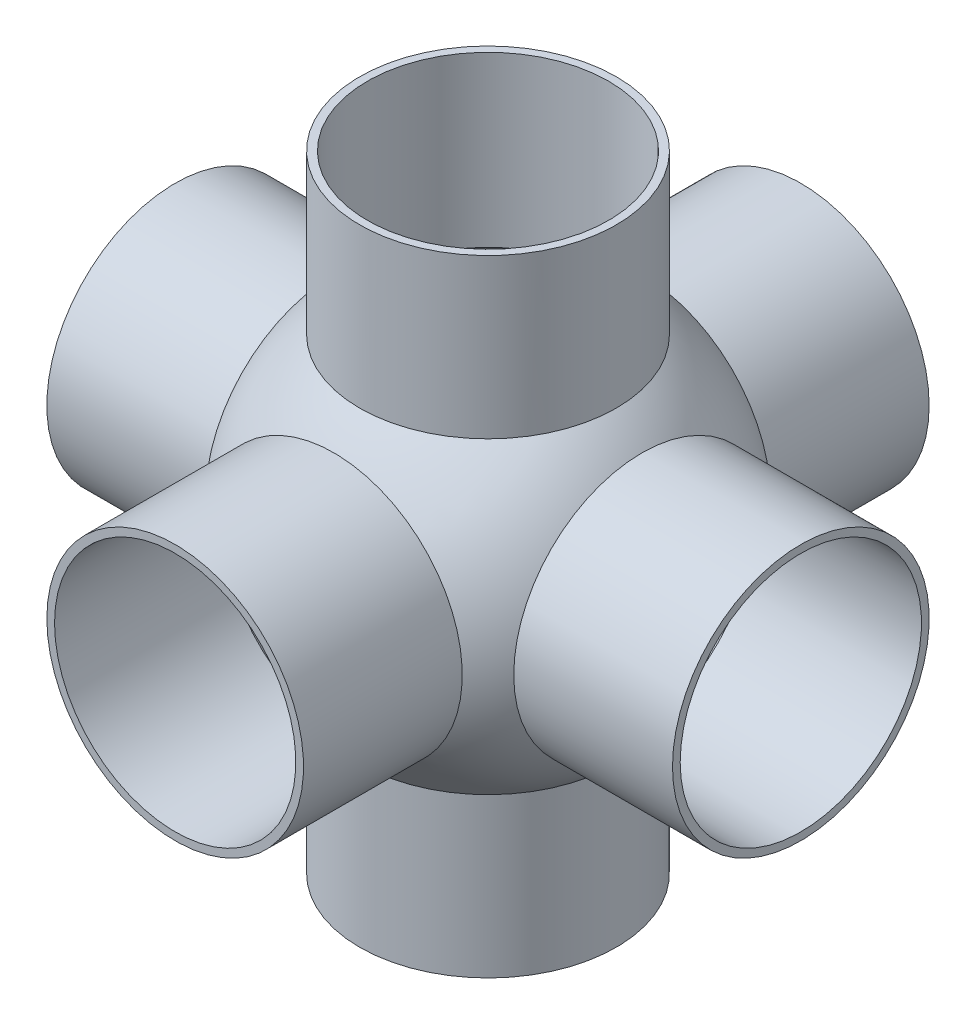
ISO-10303-21;
HEADER;
FILE_DESCRIPTION(('STEP AP214'),'2;1');
FILE_NAME('part.step','',(''),(''),'','','');
FILE_SCHEMA(('AUTOMOTIVE_DESIGN { 1 0 10303 214 1 1 1 1 }'));
ENDSEC;
DATA;
#1=APPLICATION_CONTEXT('core data for automotive mechanical design processes');
#2=APPLICATION_PROTOCOL_DEFINITION('international standard','automotive_design',2000,#1);
#3=PRODUCT_CONTEXT('',#1,'mechanical');
#4=PRODUCT('Part','Part','',(#3));
#5=PRODUCT_RELATED_PRODUCT_CATEGORY('part','',(#4));
#6=PRODUCT_DEFINITION_FORMATION('','',#4);
#7=PRODUCT_DEFINITION_CONTEXT('part definition',#1,'design');
#8=PRODUCT_DEFINITION('design','',#6,#7);
#9=PRODUCT_DEFINITION_SHAPE('','',#8);
#10=(LENGTH_UNIT() NAMED_UNIT(*) SI_UNIT(.MILLI.,.METRE.));
#11=(NAMED_UNIT(*) PLANE_ANGLE_UNIT() SI_UNIT($,.RADIAN.));
#12=(NAMED_UNIT(*) SI_UNIT($,.STERADIAN.) SOLID_ANGLE_UNIT());
#13=UNCERTAINTY_MEASURE_WITH_UNIT(LENGTH_MEASURE(1.E-05),#10,'distance_accuracy_value','');
#14=(GEOMETRIC_REPRESENTATION_CONTEXT(3) GLOBAL_UNCERTAINTY_ASSIGNED_CONTEXT((#13)) GLOBAL_UNIT_ASSIGNED_CONTEXT((#10,
#11,#12)) REPRESENTATION_CONTEXT('',''));
#15=CARTESIAN_POINT('',(0.,0.,0.));
#16=DIRECTION('',(0.,0.,1.));
#17=DIRECTION('',(1.,0.,0.));
#18=AXIS2_PLACEMENT_3D('',#15,#16,#17);
#19=CARTESIAN_POINT('',(0.,0.,0.));
#20=DIRECTION('',(0.,0.,1.));
#21=DIRECTION('',(-1.,0.,0.));
#22=AXIS2_PLACEMENT_3D('',#19,#20,#21);
#23=SPHERICAL_SURFACE('',#22,76.3270000000001);
#24=CARTESIAN_POINT('',(0.,-56.966401688,0.));
#25=DIRECTION('',(0.,-1.,0.));
#26=DIRECTION('',(0.,0.,-1.));
#27=AXIS2_PLACEMENT_3D('',#24,#25,#26);
#28=CIRCLE('',#27,50.8000000759985);
#29=CARTESIAN_POINT('',(0.,-56.966401688,-50.8000000759985));
#30=VERTEX_POINT('',#29);
#31=EDGE_CURVE('E92',#30,#30,#28,.T.);
#32=ORIENTED_EDGE('',*,*,#31,.T.);
#33=EDGE_LOOP('',(#32));
#34=FACE_BOUND('',#33,.T.);
#35=CARTESIAN_POINT('',(0.,56.966401688,0.));
#36=DIRECTION('',(0.,-1.,0.));
#37=DIRECTION('',(0.,0.,-1.));
#38=AXIS2_PLACEMENT_3D('',#35,#36,#37);
#39=CIRCLE('',#38,50.8000000759985);
#40=CARTESIAN_POINT('',(0.,56.966401688,-50.8000000759985));
#41=VERTEX_POINT('',#40);
#42=EDGE_CURVE('E95',#41,#41,#39,.T.);
#43=ORIENTED_EDGE('',*,*,#42,.F.);
#44=EDGE_LOOP('',(#43));
#45=FACE_BOUND('',#44,.T.);
#46=CARTESIAN_POINT('',(0.,0.,-56.9664017257513));
#47=DIRECTION('',(0.,0.,1.));
#48=DIRECTION('',(0.,-1.,0.));
#49=AXIS2_PLACEMENT_3D('',#46,#47,#48);
#50=CIRCLE('',#49,50.8000000336648);
#51=CARTESIAN_POINT('',(0.,-50.8000000336648,-56.9664017257513));
#52=VERTEX_POINT('',#51);
#53=EDGE_CURVE('E98',#52,#52,#50,.F.);
#54=ORIENTED_EDGE('',*,*,#53,.T.);
#55=EDGE_LOOP('',(#54));
#56=FACE_BOUND('',#55,.T.);
#57=CARTESIAN_POINT('',(0.,0.,56.9664017257513));
#58=DIRECTION('',(0.,0.,1.));
#59=DIRECTION('',(0.,-1.,0.));
#60=AXIS2_PLACEMENT_3D('',#57,#58,#59);
#61=CIRCLE('',#60,50.8000000336648);
#62=CARTESIAN_POINT('',(0.,-50.8000000336648,56.9664017257513));
#63=VERTEX_POINT('',#62);
#64=EDGE_CURVE('E101',#63,#63,#61,.F.);
#65=ORIENTED_EDGE('',*,*,#64,.F.);
#66=EDGE_LOOP('',(#65));
#67=FACE_BOUND('',#66,.T.);
#68=CARTESIAN_POINT('',(-56.966401688,0.,0.));
#69=DIRECTION('',(-1.,0.,0.));
#70=DIRECTION('',(0.,0.,1.));
#71=AXIS2_PLACEMENT_3D('',#68,#69,#70);
#72=CIRCLE('',#71,50.8000000759985);
#73=CARTESIAN_POINT('',(-56.966401688,0.,50.8000000759985));
#74=VERTEX_POINT('',#73);
#75=EDGE_CURVE('E103',#74,#74,#72,.T.);
#76=ORIENTED_EDGE('',*,*,#75,.T.);
#77=EDGE_LOOP('',(#76));
#78=FACE_BOUND('',#77,.T.);
#79=CARTESIAN_POINT('',(56.966401688,0.,0.));
#80=DIRECTION('',(-1.,0.,0.));
#81=DIRECTION('',(0.,0.,1.));
#82=AXIS2_PLACEMENT_3D('',#79,#80,#81);
#83=CIRCLE('',#82,50.8000000759986);
#84=CARTESIAN_POINT('',(56.966401688,0.,50.8000000759986));
#85=VERTEX_POINT('',#84);
#86=EDGE_CURVE('E16',#85,#85,#83,.T.);
#87=ORIENTED_EDGE('',*,*,#86,.F.);
#88=EDGE_LOOP('',(#87));
#89=FACE_BOUND('',#88,.T.);
#90=ADVANCED_FACE('F13',(#34,#45,#56,#67,#78,#89),#23,.F.);
#91=CARTESIAN_POINT('',(56.966401688,0.,0.));
#92=DIRECTION('',(-1.,0.,0.));
#93=DIRECTION('',(0.,0.,1.));
#94=AXIS2_PLACEMENT_3D('',#91,#92,#93);
#95=PLANE('',#94);
#96=CARTESIAN_POINT('',(56.966401688,0.,0.));
#97=DIRECTION('',(-1.,0.,0.));
#98=DIRECTION('',(0.,0.,1.));
#99=AXIS2_PLACEMENT_3D('',#96,#97,#98);
#100=CIRCLE('',#99,47.752);
#101=CARTESIAN_POINT('',(56.966401688,0.,47.752));
#102=VERTEX_POINT('',#101);
#103=EDGE_CURVE('E89',#102,#102,#100,.F.);
#104=ORIENTED_EDGE('',*,*,#103,.T.);
#105=EDGE_LOOP('',(#104));
#106=FACE_BOUND('',#105,.T.);
#107=ORIENTED_EDGE('',*,*,#86,.T.);
#108=EDGE_LOOP('',(#107));
#109=FACE_BOUND('',#108,.T.);
#110=ADVANCED_FACE('F110',(#106,#109),#95,.T.);
#111=CARTESIAN_POINT('',(-56.966401688,0.,0.));
#112=DIRECTION('',(-1.,0.,0.));
#113=DIRECTION('',(0.,0.,1.));
#114=AXIS2_PLACEMENT_3D('',#111,#112,#113);
#115=PLANE('',#114);
#116=CARTESIAN_POINT('',(-56.966401688,0.,0.));
#117=DIRECTION('',(1.,0.,0.));
#118=DIRECTION('',(0.,0.,-1.));
#119=AXIS2_PLACEMENT_3D('',#116,#117,#118);
#120=CIRCLE('',#119,47.752);
#121=CARTESIAN_POINT('',(-56.966401688,0.,-47.752));
#122=VERTEX_POINT('',#121);
#123=EDGE_CURVE('E86',#122,#122,#120,.F.);
#124=ORIENTED_EDGE('',*,*,#123,.T.);
#125=EDGE_LOOP('',(#124));
#126=FACE_BOUND('',#125,.T.);
#127=ORIENTED_EDGE('',*,*,#75,.F.);
#128=EDGE_LOOP('',(#127));
#129=FACE_BOUND('',#128,.T.);
#130=ADVANCED_FACE('F118',(#126,#129),#115,.F.);
#131=CARTESIAN_POINT('',(0.,0.,56.966401688));
#132=DIRECTION('',(0.,0.,-1.));
#133=DIRECTION('',(-1.,0.,0.));
#134=AXIS2_PLACEMENT_3D('',#131,#132,#133);
#135=PLANE('',#134);
#136=CARTESIAN_POINT('',(0.,0.,56.966401688));
#137=DIRECTION('',(0.,0.,-1.));
#138=DIRECTION('',(-1.,0.,0.));
#139=AXIS2_PLACEMENT_3D('',#136,#137,#138);
#140=CIRCLE('',#139,47.752);
#141=CARTESIAN_POINT('',(-47.752,0.,56.966401688));
#142=VERTEX_POINT('',#141);
#143=EDGE_CURVE('E83',#142,#142,#140,.F.);
#144=ORIENTED_EDGE('',*,*,#143,.T.);
#145=EDGE_LOOP('',(#144));
#146=FACE_BOUND('',#145,.T.);
#147=ORIENTED_EDGE('',*,*,#64,.T.);
#148=EDGE_LOOP('',(#147));
#149=FACE_BOUND('',#148,.T.);
#150=ADVANCED_FACE('F200',(#146,#149),#135,.T.);
#151=CARTESIAN_POINT('',(0.,0.,-56.966401688));
#152=DIRECTION('',(0.,0.,-1.));
#153=DIRECTION('',(-1.,0.,0.));
#154=AXIS2_PLACEMENT_3D('',#151,#152,#153);
#155=PLANE('',#154);
#156=CARTESIAN_POINT('',(0.,0.,-56.966401688));
#157=DIRECTION('',(0.,0.,1.));
#158=DIRECTION('',(1.,0.,0.));
#159=AXIS2_PLACEMENT_3D('',#156,#157,#158);
#160=CIRCLE('',#159,47.752);
#161=CARTESIAN_POINT('',(47.752,0.,-56.966401688));
#162=VERTEX_POINT('',#161);
#163=EDGE_CURVE('E80',#162,#162,#160,.F.);
#164=ORIENTED_EDGE('',*,*,#163,.T.);
#165=EDGE_LOOP('',(#164));
#166=FACE_BOUND('',#165,.T.);
#167=ORIENTED_EDGE('',*,*,#53,.F.);
#168=EDGE_LOOP('',(#167));
#169=FACE_BOUND('',#168,.T.);
#170=ADVANCED_FACE('F196',(#166,#169),#155,.F.);
#171=CARTESIAN_POINT('',(0.,56.966401688,0.));
#172=DIRECTION('',(0.,-1.,0.));
#173=DIRECTION('',(0.,0.,-1.));
#174=AXIS2_PLACEMENT_3D('',#171,#172,#173);
#175=PLANE('',#174);
#176=CARTESIAN_POINT('',(0.,56.966401688,0.));
#177=DIRECTION('',(0.,-1.,0.));
#178=DIRECTION('',(0.,0.,-1.));
#179=AXIS2_PLACEMENT_3D('',#176,#177,#178);
#180=CIRCLE('',#179,47.752);
#181=CARTESIAN_POINT('',(0.,56.966401688,-47.752));
#182=VERTEX_POINT('',#181);
#183=EDGE_CURVE('E77',#182,#182,#180,.F.);
#184=ORIENTED_EDGE('',*,*,#183,.T.);
#185=EDGE_LOOP('',(#184));
#186=FACE_BOUND('',#185,.T.);
#187=ORIENTED_EDGE('',*,*,#42,.T.);
#188=EDGE_LOOP('',(#187));
#189=FACE_BOUND('',#188,.T.);
#190=ADVANCED_FACE('F192',(#186,#189),#175,.T.);
#191=CARTESIAN_POINT('',(0.,-56.966401688,0.));
#192=DIRECTION('',(0.,-1.,0.));
#193=DIRECTION('',(0.,0.,-1.));
#194=AXIS2_PLACEMENT_3D('',#191,#192,#193);
#195=PLANE('',#194);
#196=CARTESIAN_POINT('',(0.,-56.966401688,0.));
#197=DIRECTION('',(0.,1.,0.));
#198=DIRECTION('',(0.,0.,1.));
#199=AXIS2_PLACEMENT_3D('',#196,#197,#198);
#200=CIRCLE('',#199,47.752);
#201=CARTESIAN_POINT('',(0.,-56.966401688,47.752));
#202=VERTEX_POINT('',#201);
#203=EDGE_CURVE('E74',#202,#202,#200,.F.);
#204=ORIENTED_EDGE('',*,*,#203,.T.);
#205=EDGE_LOOP('',(#204));
#206=FACE_BOUND('',#205,.T.);
#207=ORIENTED_EDGE('',*,*,#31,.F.);
#208=EDGE_LOOP('',(#207));
#209=FACE_BOUND('',#208,.T.);
#210=ADVANCED_FACE('F188',(#206,#209),#195,.F.);
#211=CARTESIAN_POINT('',(123.825,0.,0.));
#212=DIRECTION('',(-1.,0.,0.));
#213=DIRECTION('',(0.,0.,1.));
#214=AXIS2_PLACEMENT_3D('',#211,#212,#213);
#215=CYLINDRICAL_SURFACE('',#214,47.752);
#216=CARTESIAN_POINT('',(123.825,0.,0.));
#217=DIRECTION('',(-1.,0.,0.));
#218=DIRECTION('',(0.,0.,1.));
#219=AXIS2_PLACEMENT_3D('',#216,#217,#218);
#220=CIRCLE('',#219,47.752);
#221=CARTESIAN_POINT('',(123.825,0.,47.752));
#222=VERTEX_POINT('',#221);
#223=EDGE_CURVE('E71',#222,#222,#220,.F.);
#224=ORIENTED_EDGE('',*,*,#223,.T.);
#225=EDGE_LOOP('',(#224));
#226=FACE_BOUND('',#225,.T.);
#227=ORIENTED_EDGE('',*,*,#103,.F.);
#228=EDGE_LOOP('',(#227));
#229=FACE_BOUND('',#228,.T.);
#230=ADVANCED_FACE('F184',(#226,#229),#215,.F.);
#231=CARTESIAN_POINT('',(-123.825,0.,0.));
#232=DIRECTION('',(1.,0.,0.));
#233=DIRECTION('',(0.,0.,-1.));
#234=AXIS2_PLACEMENT_3D('',#231,#232,#233);
#235=CYLINDRICAL_SURFACE('',#234,47.752);
#236=CARTESIAN_POINT('',(-123.825,0.,0.));
#237=DIRECTION('',(1.,0.,0.));
#238=DIRECTION('',(0.,0.,-1.));
#239=AXIS2_PLACEMENT_3D('',#236,#237,#238);
#240=CIRCLE('',#239,47.752);
#241=CARTESIAN_POINT('',(-123.825,0.,-47.752));
#242=VERTEX_POINT('',#241);
#243=EDGE_CURVE('E68',#242,#242,#240,.T.);
#244=ORIENTED_EDGE('',*,*,#243,.F.);
#245=EDGE_LOOP('',(#244));
#246=FACE_BOUND('',#245,.T.);
#247=ORIENTED_EDGE('',*,*,#123,.F.);
#248=EDGE_LOOP('',(#247));
#249=FACE_BOUND('',#248,.T.);
#250=ADVANCED_FACE('F180',(#246,#249),#235,.F.);
#251=CARTESIAN_POINT('',(0.,0.,123.825));
#252=DIRECTION('',(0.,0.,-1.));
#253=DIRECTION('',(-1.,0.,0.));
#254=AXIS2_PLACEMENT_3D('',#251,#252,#253);
#255=CYLINDRICAL_SURFACE('',#254,47.752);
#256=CARTESIAN_POINT('',(0.,0.,123.825));
#257=DIRECTION('',(0.,0.,-1.));
#258=DIRECTION('',(-1.,0.,0.));
#259=AXIS2_PLACEMENT_3D('',#256,#257,#258);
#260=CIRCLE('',#259,47.752);
#261=CARTESIAN_POINT('',(-47.752,0.,123.825));
#262=VERTEX_POINT('',#261);
#263=EDGE_CURVE('E65',#262,#262,#260,.F.);
#264=ORIENTED_EDGE('',*,*,#263,.T.);
#265=EDGE_LOOP('',(#264));
#266=FACE_BOUND('',#265,.T.);
#267=ORIENTED_EDGE('',*,*,#143,.F.);
#268=EDGE_LOOP('',(#267));
#269=FACE_BOUND('',#268,.T.);
#270=ADVANCED_FACE('F176',(#266,#269),#255,.F.);
#271=CARTESIAN_POINT('',(0.,0.,-123.825));
#272=DIRECTION('',(0.,0.,1.));
#273=DIRECTION('',(1.,0.,0.));
#274=AXIS2_PLACEMENT_3D('',#271,#272,#273);
#275=CYLINDRICAL_SURFACE('',#274,47.752);
#276=CARTESIAN_POINT('',(0.,0.,-123.825));
#277=DIRECTION('',(0.,0.,1.));
#278=DIRECTION('',(1.,0.,0.));
#279=AXIS2_PLACEMENT_3D('',#276,#277,#278);
#280=CIRCLE('',#279,47.752);
#281=CARTESIAN_POINT('',(47.752,0.,-123.825));
#282=VERTEX_POINT('',#281);
#283=EDGE_CURVE('E62',#282,#282,#280,.T.);
#284=ORIENTED_EDGE('',*,*,#283,.F.);
#285=EDGE_LOOP('',(#284));
#286=FACE_BOUND('',#285,.T.);
#287=ORIENTED_EDGE('',*,*,#163,.F.);
#288=EDGE_LOOP('',(#287));
#289=FACE_BOUND('',#288,.T.);
#290=ADVANCED_FACE('F172',(#286,#289),#275,.F.);
#291=CARTESIAN_POINT('',(0.,123.825,0.));
#292=DIRECTION('',(0.,-1.,0.));
#293=DIRECTION('',(0.,0.,-1.));
#294=AXIS2_PLACEMENT_3D('',#291,#292,#293);
#295=CYLINDRICAL_SURFACE('',#294,47.752);
#296=CARTESIAN_POINT('',(0.,123.825,0.));
#297=DIRECTION('',(0.,-1.,0.));
#298=DIRECTION('',(0.,0.,-1.));
#299=AXIS2_PLACEMENT_3D('',#296,#297,#298);
#300=CIRCLE('',#299,47.752);
#301=CARTESIAN_POINT('',(0.,123.825,-47.752));
#302=VERTEX_POINT('',#301);
#303=EDGE_CURVE('E59',#302,#302,#300,.F.);
#304=ORIENTED_EDGE('',*,*,#303,.T.);
#305=EDGE_LOOP('',(#304));
#306=FACE_BOUND('',#305,.T.);
#307=ORIENTED_EDGE('',*,*,#183,.F.);
#308=EDGE_LOOP('',(#307));
#309=FACE_BOUND('',#308,.T.);
#310=ADVANCED_FACE('F164',(#306,#309),#295,.F.);
#311=CARTESIAN_POINT('',(0.,-123.825,0.));
#312=DIRECTION('',(0.,1.,0.));
#313=DIRECTION('',(0.,0.,1.));
#314=AXIS2_PLACEMENT_3D('',#311,#312,#313);
#315=CYLINDRICAL_SURFACE('',#314,47.752);
#316=CARTESIAN_POINT('',(0.,-123.825,0.));
#317=DIRECTION('',(0.,1.,0.));
#318=DIRECTION('',(0.,0.,1.));
#319=AXIS2_PLACEMENT_3D('',#316,#317,#318);
#320=CIRCLE('',#319,47.752);
#321=CARTESIAN_POINT('',(0.,-123.825,47.752));
#322=VERTEX_POINT('',#321);
#323=EDGE_CURVE('E56',#322,#322,#320,.T.);
#324=ORIENTED_EDGE('',*,*,#323,.F.);
#325=EDGE_LOOP('',(#324));
#326=FACE_BOUND('',#325,.T.);
#327=ORIENTED_EDGE('',*,*,#203,.F.);
#328=EDGE_LOOP('',(#327));
#329=FACE_BOUND('',#328,.T.);
#330=ADVANCED_FACE('F154',(#326,#329),#315,.F.);
#331=CARTESIAN_POINT('',(123.825,0.,0.));
#332=DIRECTION('',(-1.,0.,0.));
#333=DIRECTION('',(0.,0.,1.));
#334=AXIS2_PLACEMENT_3D('',#331,#332,#333);
#335=PLANE('',#334);
#336=ORIENTED_EDGE('',*,*,#223,.F.);
#337=EDGE_LOOP('',(#336));
#338=FACE_BOUND('',#337,.T.);
#339=CARTESIAN_POINT('',(123.825,0.,0.));
#340=DIRECTION('',(-1.,0.,0.));
#341=DIRECTION('',(0.,0.,1.));
#342=AXIS2_PLACEMENT_3D('',#339,#340,#341);
#343=CIRCLE('',#342,50.8);
#344=CARTESIAN_POINT('',(123.825,0.,50.8));
#345=VERTEX_POINT('',#344);
#346=EDGE_CURVE('E53',#345,#345,#343,.T.);
#347=ORIENTED_EDGE('',*,*,#346,.F.);
#348=EDGE_LOOP('',(#347));
#349=FACE_BOUND('',#348,.T.);
#350=ADVANCED_FACE('F151',(#338,#349),#335,.F.);
#351=CARTESIAN_POINT('',(-123.825,0.,0.));
#352=DIRECTION('',(-1.,0.,0.));
#353=DIRECTION('',(0.,0.,1.));
#354=AXIS2_PLACEMENT_3D('',#351,#352,#353);
#355=PLANE('',#354);
#356=ORIENTED_EDGE('',*,*,#243,.T.);
#357=EDGE_LOOP('',(#356));
#358=FACE_BOUND('',#357,.T.);
#359=CARTESIAN_POINT('',(-123.825,0.,0.));
#360=DIRECTION('',(1.,0.,0.));
#361=DIRECTION('',(0.,0.,-1.));
#362=AXIS2_PLACEMENT_3D('',#359,#360,#361);
#363=CIRCLE('',#362,50.8);
#364=CARTESIAN_POINT('',(-123.825,0.,-50.8));
#365=VERTEX_POINT('',#364);
#366=EDGE_CURVE('E50',#365,#365,#363,.T.);
#367=ORIENTED_EDGE('',*,*,#366,.F.);
#368=EDGE_LOOP('',(#367));
#369=FACE_BOUND('',#368,.T.);
#370=ADVANCED_FACE('F153',(#358,#369),#355,.T.);
#371=CARTESIAN_POINT('',(0.,0.,123.825));
#372=DIRECTION('',(0.,0.,-1.));
#373=DIRECTION('',(-1.,0.,0.));
#374=AXIS2_PLACEMENT_3D('',#371,#372,#373);
#375=PLANE('',#374);
#376=ORIENTED_EDGE('',*,*,#263,.F.);
#377=EDGE_LOOP('',(#376));
#378=FACE_BOUND('',#377,.T.);
#379=CARTESIAN_POINT('',(0.,0.,123.825));
#380=DIRECTION('',(0.,0.,-1.));
#381=DIRECTION('',(-1.,0.,0.));
#382=AXIS2_PLACEMENT_3D('',#379,#380,#381);
#383=CIRCLE('',#382,50.8);
#384=CARTESIAN_POINT('',(-50.8,0.,123.825));
#385=VERTEX_POINT('',#384);
#386=EDGE_CURVE('E47',#385,#385,#383,.T.);
#387=ORIENTED_EDGE('',*,*,#386,.F.);
#388=EDGE_LOOP('',(#387));
#389=FACE_BOUND('',#388,.T.);
#390=ADVANCED_FACE('F161',(#378,#389),#375,.F.);
#391=CARTESIAN_POINT('',(0.,0.,-123.825));
#392=DIRECTION('',(0.,0.,-1.));
#393=DIRECTION('',(-1.,0.,0.));
#394=AXIS2_PLACEMENT_3D('',#391,#392,#393);
#395=PLANE('',#394);
#396=ORIENTED_EDGE('',*,*,#283,.T.);
#397=EDGE_LOOP('',(#396));
#398=FACE_BOUND('',#397,.T.);
#399=CARTESIAN_POINT('',(0.,0.,-123.825));
#400=DIRECTION('',(0.,0.,1.));
#401=DIRECTION('',(1.,0.,0.));
#402=AXIS2_PLACEMENT_3D('',#399,#400,#401);
#403=CIRCLE('',#402,50.8);
#404=CARTESIAN_POINT('',(50.8,0.,-123.825));
#405=VERTEX_POINT('',#404);
#406=EDGE_CURVE('E44',#405,#405,#403,.T.);
#407=ORIENTED_EDGE('',*,*,#406,.F.);
#408=EDGE_LOOP('',(#407));
#409=FACE_BOUND('',#408,.T.);
#410=ADVANCED_FACE('F278',(#398,#409),#395,.T.);
#411=CARTESIAN_POINT('',(0.,123.825,0.));
#412=DIRECTION('',(0.,-1.,0.));
#413=DIRECTION('',(0.,0.,-1.));
#414=AXIS2_PLACEMENT_3D('',#411,#412,#413);
#415=PLANE('',#414);
#416=ORIENTED_EDGE('',*,*,#303,.F.);
#417=EDGE_LOOP('',(#416));
#418=FACE_BOUND('',#417,.T.);
#419=CARTESIAN_POINT('',(0.,123.825,0.));
#420=DIRECTION('',(0.,-1.,0.));
#421=DIRECTION('',(0.,0.,-1.));
#422=AXIS2_PLACEMENT_3D('',#419,#420,#421);
#423=CIRCLE('',#422,50.8);
#424=CARTESIAN_POINT('',(0.,123.825,-50.8));
#425=VERTEX_POINT('',#424);
#426=EDGE_CURVE('E41',#425,#425,#423,.T.);
#427=ORIENTED_EDGE('',*,*,#426,.F.);
#428=EDGE_LOOP('',(#427));
#429=FACE_BOUND('',#428,.T.);
#430=ADVANCED_FACE('F287',(#418,#429),#415,.F.);
#431=CARTESIAN_POINT('',(0.,-123.825,0.));
#432=DIRECTION('',(0.,-1.,0.));
#433=DIRECTION('',(0.,0.,-1.));
#434=AXIS2_PLACEMENT_3D('',#431,#432,#433);
#435=PLANE('',#434);
#436=ORIENTED_EDGE('',*,*,#323,.T.);
#437=EDGE_LOOP('',(#436));
#438=FACE_BOUND('',#437,.T.);
#439=CARTESIAN_POINT('',(0.,-123.825,0.));
#440=DIRECTION('',(0.,1.,0.));
#441=DIRECTION('',(0.,0.,1.));
#442=AXIS2_PLACEMENT_3D('',#439,#440,#441);
#443=CIRCLE('',#442,50.8);
#444=CARTESIAN_POINT('',(0.,-123.825,50.8));
#445=VERTEX_POINT('',#444);
#446=EDGE_CURVE('E37',#445,#445,#443,.T.);
#447=ORIENTED_EDGE('',*,*,#446,.F.);
#448=EDGE_LOOP('',(#447));
#449=FACE_BOUND('',#448,.T.);
#450=ADVANCED_FACE('F147',(#438,#449),#435,.T.);
#451=CARTESIAN_POINT('',(123.825,0.,0.));
#452=DIRECTION('',(-1.,0.,0.));
#453=DIRECTION('',(0.,0.,1.));
#454=AXIS2_PLACEMENT_3D('',#451,#452,#453);
#455=CYLINDRICAL_SURFACE('',#454,50.8);
#456=CARTESIAN_POINT('',(60.989758361548,0.,0.));
#457=DIRECTION('',(1.,0.,0.));
#458=DIRECTION('',(0.,1.,0.));
#459=AXIS2_PLACEMENT_3D('',#456,#457,#458);
#460=CIRCLE('',#459,50.8);
#461=CARTESIAN_POINT('',(60.989758361548,50.8,0.));
#462=VERTEX_POINT('',#461);
#463=EDGE_CURVE('E40',#462,#462,#460,.F.);
#464=ORIENTED_EDGE('',*,*,#463,.F.);
#465=EDGE_LOOP('',(#464));
#466=FACE_BOUND('',#465,.T.);
#467=ORIENTED_EDGE('',*,*,#346,.T.);
#468=EDGE_LOOP('',(#467));
#469=FACE_BOUND('',#468,.T.);
#470=ADVANCED_FACE('F143',(#466,#469),#455,.T.);
#471=CARTESIAN_POINT('',(-123.825,0.,0.));
#472=DIRECTION('',(1.,0.,0.));
#473=DIRECTION('',(0.,0.,-1.));
#474=AXIS2_PLACEMENT_3D('',#471,#472,#473);
#475=CYLINDRICAL_SURFACE('',#474,50.8);
#476=CARTESIAN_POINT('',(-60.9897583615481,0.,0.));
#477=DIRECTION('',(1.,0.,0.));
#478=DIRECTION('',(0.,1.,0.));
#479=AXIS2_PLACEMENT_3D('',#476,#477,#478);
#480=CIRCLE('',#479,50.8);
#481=CARTESIAN_POINT('',(-60.9897583615481,50.8,0.));
#482=VERTEX_POINT('',#481);
#483=EDGE_CURVE('E36',#482,#482,#480,.T.);
#484=ORIENTED_EDGE('',*,*,#483,.F.);
#485=EDGE_LOOP('',(#484));
#486=FACE_BOUND('',#485,.T.);
#487=ORIENTED_EDGE('',*,*,#366,.T.);
#488=EDGE_LOOP('',(#487));
#489=FACE_BOUND('',#488,.T.);
#490=ADVANCED_FACE('F146',(#486,#489),#475,.T.);
#491=CARTESIAN_POINT('',(0.,0.,123.825));
#492=DIRECTION('',(0.,0.,-1.));
#493=DIRECTION('',(-1.,0.,0.));
#494=AXIS2_PLACEMENT_3D('',#491,#492,#493);
#495=CYLINDRICAL_SURFACE('',#494,50.8);
#496=CARTESIAN_POINT('',(0.,0.,60.9897583615481));
#497=DIRECTION('',(0.,0.,-1.));
#498=DIRECTION('',(-1.,0.,0.));
#499=AXIS2_PLACEMENT_3D('',#496,#497,#498);
#500=CIRCLE('',#499,50.8);
#501=CARTESIAN_POINT('',(-50.8,0.,60.9897583615481));
#502=VERTEX_POINT('',#501);
#503=EDGE_CURVE('E33',#502,#502,#500,.T.);
#504=ORIENTED_EDGE('',*,*,#503,.F.);
#505=EDGE_LOOP('',(#504));
#506=FACE_BOUND('',#505,.T.);
#507=ORIENTED_EDGE('',*,*,#386,.T.);
#508=EDGE_LOOP('',(#507));
#509=FACE_BOUND('',#508,.T.);
#510=ADVANCED_FACE('F321',(#506,#509),#495,.T.);
#511=CARTESIAN_POINT('',(0.,0.,-123.825));
#512=DIRECTION('',(0.,0.,1.));
#513=DIRECTION('',(1.,0.,0.));
#514=AXIS2_PLACEMENT_3D('',#511,#512,#513);
#515=CYLINDRICAL_SURFACE('',#514,50.8);
#516=CARTESIAN_POINT('',(0.,0.,-60.9897583615481));
#517=DIRECTION('',(0.,0.,1.));
#518=DIRECTION('',(1.,0.,0.));
#519=AXIS2_PLACEMENT_3D('',#516,#517,#518);
#520=CIRCLE('',#519,50.8);
#521=CARTESIAN_POINT('',(50.8,0.,-60.9897583615481));
#522=VERTEX_POINT('',#521);
#523=EDGE_CURVE('E25',#522,#522,#520,.T.);
#524=ORIENTED_EDGE('',*,*,#523,.F.);
#525=EDGE_LOOP('',(#524));
#526=FACE_BOUND('',#525,.T.);
#527=ORIENTED_EDGE('',*,*,#406,.T.);
#528=EDGE_LOOP('',(#527));
#529=FACE_BOUND('',#528,.T.);
#530=ADVANCED_FACE('F331',(#526,#529),#515,.T.);
#531=CARTESIAN_POINT('',(0.,123.825,0.));
#532=DIRECTION('',(0.,-1.,0.));
#533=DIRECTION('',(0.,0.,-1.));
#534=AXIS2_PLACEMENT_3D('',#531,#532,#533);
#535=CYLINDRICAL_SURFACE('',#534,50.8);
#536=CARTESIAN_POINT('',(0.,60.9897583615481,0.));
#537=DIRECTION('',(0.,-1.,0.));
#538=DIRECTION('',(0.,0.,-1.));
#539=AXIS2_PLACEMENT_3D('',#536,#537,#538);
#540=CIRCLE('',#539,50.8);
#541=CARTESIAN_POINT('',(0.,60.9897583615481,-50.8));
#542=VERTEX_POINT('',#541);
#543=EDGE_CURVE('E20',#542,#542,#540,.T.);
#544=ORIENTED_EDGE('',*,*,#543,.F.);
#545=EDGE_LOOP('',(#544));
#546=FACE_BOUND('',#545,.T.);
#547=ORIENTED_EDGE('',*,*,#426,.T.);
#548=EDGE_LOOP('',(#547));
#549=FACE_BOUND('',#548,.T.);
#550=ADVANCED_FACE('F128',(#546,#549),#535,.T.);
#551=CARTESIAN_POINT('',(0.,-123.825,0.));
#552=DIRECTION('',(0.,1.,0.));
#553=DIRECTION('',(0.,0.,1.));
#554=AXIS2_PLACEMENT_3D('',#551,#552,#553);
#555=CYLINDRICAL_SURFACE('',#554,50.8);
#556=CARTESIAN_POINT('',(0.,-60.9897583615481,0.));
#557=DIRECTION('',(0.,1.,0.));
#558=DIRECTION('',(0.,0.,1.));
#559=AXIS2_PLACEMENT_3D('',#556,#557,#558);
#560=CIRCLE('',#559,50.8);
#561=CARTESIAN_POINT('',(0.,-60.9897583615481,50.8));
#562=VERTEX_POINT('',#561);
#563=EDGE_CURVE('E9',#562,#562,#560,.T.);
#564=ORIENTED_EDGE('',*,*,#563,.F.);
#565=EDGE_LOOP('',(#564));
#566=FACE_BOUND('',#565,.T.);
#567=ORIENTED_EDGE('',*,*,#446,.T.);
#568=EDGE_LOOP('',(#567));
#569=FACE_BOUND('',#568,.T.);
#570=ADVANCED_FACE('F123',(#566,#569),#555,.T.);
#571=CARTESIAN_POINT('',(0.,0.,0.));
#572=DIRECTION('',(1.,0.,0.));
#573=DIRECTION('',(0.,1.,0.));
#574=AXIS2_PLACEMENT_3D('',#571,#572,#573);
#575=SPHERICAL_SURFACE('',#574,79.3750000000001);
#576=ORIENTED_EDGE('',*,*,#563,.T.);
#577=EDGE_LOOP('',(#576));
#578=FACE_BOUND('',#577,.T.);
#579=ORIENTED_EDGE('',*,*,#543,.T.);
#580=EDGE_LOOP('',(#579));
#581=FACE_BOUND('',#580,.T.);
#582=ORIENTED_EDGE('',*,*,#523,.T.);
#583=EDGE_LOOP('',(#582));
#584=FACE_BOUND('',#583,.T.);
#585=ORIENTED_EDGE('',*,*,#503,.T.);
#586=EDGE_LOOP('',(#585));
#587=FACE_BOUND('',#586,.T.);
#588=ORIENTED_EDGE('',*,*,#483,.T.);
#589=EDGE_LOOP('',(#588));
#590=FACE_BOUND('',#589,.T.);
#591=ORIENTED_EDGE('',*,*,#463,.T.);
#592=EDGE_LOOP('',(#591));
#593=FACE_BOUND('',#592,.T.);
#594=ADVANCED_FACE('F121',(#578,#581,#584,#587,#590,#593),#575,.T.);
#595=CLOSED_SHELL('',(#90,#110,#130,#150,#170,#190,#210,#230,#250,#270,#290,#310,#330,#350,#370,
#390,#410,#430,#450,#470,#490,#510,#530,#550,#570,#594));
#596=MANIFOLD_SOLID_BREP('B1',#595);
#597=ADVANCED_BREP_SHAPE_REPRESENTATION('',(#18,#596),#14);
#598=SHAPE_DEFINITION_REPRESENTATION(#9,#597);
ENDSEC;
END-ISO-10303-21;
